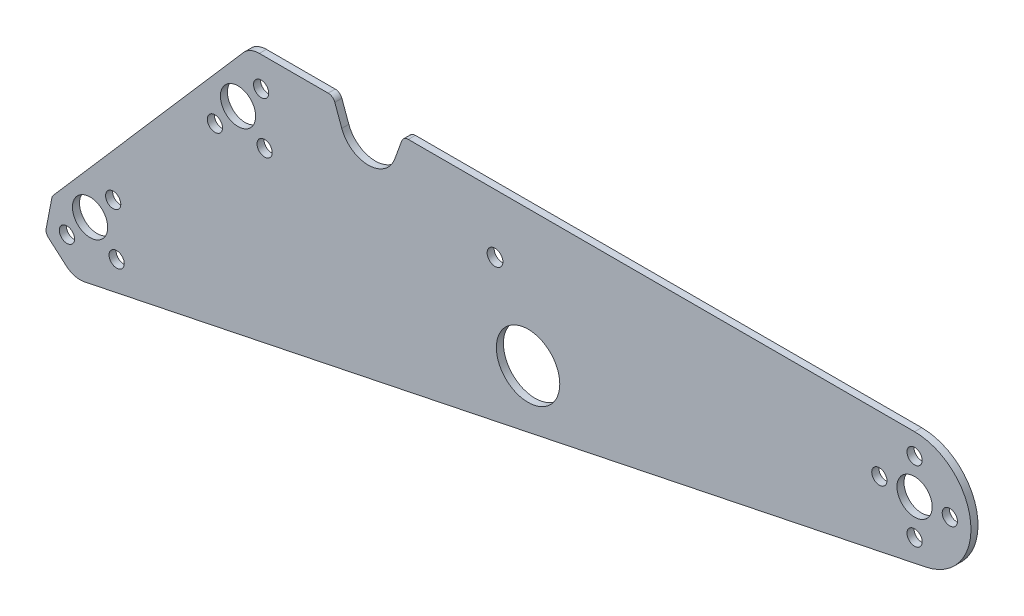
ISO-10303-21;
HEADER;
FILE_DESCRIPTION(('STEP AP214'),'2;1');
FILE_NAME('part.step','',(''),(''),'','','');
FILE_SCHEMA(('AUTOMOTIVE_DESIGN { 1 0 10303 214 1 1 1 1 }'));
ENDSEC;
DATA;
#1=APPLICATION_CONTEXT('core data for automotive mechanical design processes');
#2=APPLICATION_PROTOCOL_DEFINITION('international standard','automotive_design',2000,#1);
#3=PRODUCT_CONTEXT('',#1,'mechanical');
#4=PRODUCT('Part','Part','',(#3));
#5=PRODUCT_RELATED_PRODUCT_CATEGORY('part','',(#4));
#6=PRODUCT_DEFINITION_FORMATION('','',#4);
#7=PRODUCT_DEFINITION_CONTEXT('part definition',#1,'design');
#8=PRODUCT_DEFINITION('design','',#6,#7);
#9=PRODUCT_DEFINITION_SHAPE('','',#8);
#10=(LENGTH_UNIT() NAMED_UNIT(*) SI_UNIT(.MILLI.,.METRE.));
#11=(NAMED_UNIT(*) PLANE_ANGLE_UNIT() SI_UNIT($,.RADIAN.));
#12=(NAMED_UNIT(*) SI_UNIT($,.STERADIAN.) SOLID_ANGLE_UNIT());
#13=UNCERTAINTY_MEASURE_WITH_UNIT(LENGTH_MEASURE(1.E-05),#10,'distance_accuracy_value','');
#14=(GEOMETRIC_REPRESENTATION_CONTEXT(3) GLOBAL_UNCERTAINTY_ASSIGNED_CONTEXT((#13)) GLOBAL_UNIT_ASSIGNED_CONTEXT((#10,
#11,#12)) REPRESENTATION_CONTEXT('',''));
#15=CARTESIAN_POINT('',(0.,0.,0.));
#16=DIRECTION('',(0.,0.,1.));
#17=DIRECTION('',(1.,0.,0.));
#18=AXIS2_PLACEMENT_3D('',#15,#16,#17);
#19=CARTESIAN_POINT('',(-83.3352427436473,-91.627512591668,3.175));
#20=DIRECTION('',(0.,0.,1.));
#21=DIRECTION('',(1.,0.,0.));
#22=AXIS2_PLACEMENT_3D('',#19,#20,#21);
#23=PLANE('',#22);
#24=CARTESIAN_POINT('',(10.4149370852242,11.9810145860366,3.175));
#25=DIRECTION('',(0.,0.,1.));
#26=DIRECTION('',(1.,0.,0.));
#27=AXIS2_PLACEMENT_3D('',#24,#25,#26);
#28=CIRCLE('',#27,3.429);
#29=CARTESIAN_POINT('',(13.8439370852242,11.9810145860366,3.175));
#30=VERTEX_POINT('',#29);
#31=EDGE_CURVE('E446',#30,#30,#28,.T.);
#32=ORIENTED_EDGE('',*,*,#31,.F.);
#33=EDGE_LOOP('',(#32));
#34=FACE_BOUND('',#33,.T.);
#35=CARTESIAN_POINT('',(304.800000000001,-15.875,3.175));
#36=DIRECTION('',(0.,0.,1.));
#37=DIRECTION('',(1.,0.,0.));
#38=AXIS2_PLACEMENT_3D('',#35,#36,#37);
#39=CIRCLE('',#38,3.429);
#40=CARTESIAN_POINT('',(308.229000000001,-15.875,3.175));
#41=VERTEX_POINT('',#40);
#42=EDGE_CURVE('E462',#41,#41,#39,.T.);
#43=ORIENTED_EDGE('',*,*,#42,.F.);
#44=EDGE_LOOP('',(#43));
#45=FACE_BOUND('',#44,.T.);
#46=CARTESIAN_POINT('',(11.9810145860366,-10.4149370852242,3.175));
#47=DIRECTION('',(0.,0.,1.));
#48=DIRECTION('',(1.,0.,0.));
#49=AXIS2_PLACEMENT_3D('',#46,#47,#48);
#50=CIRCLE('',#49,3.429);
#51=CARTESIAN_POINT('',(15.4100145860366,-10.4149370852242,3.175));
#52=VERTEX_POINT('',#51);
#53=EDGE_CURVE('E478',#52,#52,#50,.T.);
#54=ORIENTED_EDGE('',*,*,#53,.F.);
#55=EDGE_LOOP('',(#54));
#56=FACE_BOUND('',#55,.T.);
#57=CARTESIAN_POINT('',(304.8,15.875,3.175));
#58=DIRECTION('',(0.,0.,1.));
#59=DIRECTION('',(1.,0.,0.));
#60=AXIS2_PLACEMENT_3D('',#57,#58,#59);
#61=CIRCLE('',#60,3.429);
#62=CARTESIAN_POINT('',(308.229,15.875,3.175));
#63=VERTEX_POINT('',#62);
#64=EDGE_CURVE('E494',#63,#63,#61,.T.);
#65=ORIENTED_EDGE('',*,*,#64,.F.);
#66=EDGE_LOOP('',(#65));
#67=FACE_BOUND('',#66,.T.);
#68=CARTESIAN_POINT('',(-56.2406602602111,-64.6974787645972,3.175));
#69=DIRECTION('',(0.,0.,1.));
#70=DIRECTION('',(1.,0.,0.));
#71=AXIS2_PLACEMENT_3D('',#68,#69,#70);
#72=CIRCLE('',#71,3.429);
#73=CARTESIAN_POINT('',(-52.8116602602111,-64.6974787645972,3.175));
#74=VERTEX_POINT('',#73);
#75=EDGE_CURVE('E510',#74,#74,#72,.T.);
#76=ORIENTED_EDGE('',*,*,#75,.F.);
#77=EDGE_LOOP('',(#76));
#78=FACE_BOUND('',#77,.T.);
#79=CARTESIAN_POINT('',(-10.4149370852243,-11.9810145860365,3.175));
#80=DIRECTION('',(0.,0.,1.));
#81=DIRECTION('',(1.,0.,0.));
#82=AXIS2_PLACEMENT_3D('',#79,#80,#81);
#83=CIRCLE('',#82,3.429);
#84=CARTESIAN_POINT('',(-6.98593708522428,-11.9810145860365,3.175));
#85=VERTEX_POINT('',#84);
#86=EDGE_CURVE('E526',#85,#85,#83,.T.);
#87=ORIENTED_EDGE('',*,*,#86,.F.);
#88=EDGE_LOOP('',(#87));
#89=FACE_BOUND('',#88,.T.);
#90=CARTESIAN_POINT('',(0.,0.,3.175));
#91=DIRECTION('',(0.,0.,1.));
#92=DIRECTION('',(1.,0.,0.));
#93=AXIS2_PLACEMENT_3D('',#90,#91,#92);
#94=CIRCLE('',#93,7.93750000000001);
#95=CARTESIAN_POINT('',(7.93750000000001,0.,3.175));
#96=VERTEX_POINT('',#95);
#97=EDGE_CURVE('E542',#96,#96,#94,.T.);
#98=ORIENTED_EDGE('',*,*,#97,.F.);
#99=EDGE_LOOP('',(#98));
#100=FACE_BOUND('',#99,.T.);
#101=CARTESIAN_POINT('',(-83.3352427436473,-91.627512591668,3.175));
#102=DIRECTION('',(0.,0.,1.));
#103=DIRECTION('',(1.,0.,0.));
#104=AXIS2_PLACEMENT_3D('',#101,#102,#103);
#105=CIRCLE('',#104,3.175);
#106=CARTESIAN_POINT('',(-86.4519090510937,-91.0216940313475,3.175));
#107=VERTEX_POINT('',#106);
#108=CARTESIAN_POINT('',(-85.4182301606922,-94.0237155088753,3.175));
#109=VERTEX_POINT('',#108);
#110=EDGE_CURVE('E242',#107,#109,#105,.T.);
#111=ORIENTED_EDGE('',*,*,#110,.T.);
#112=DIRECTION('',(0.754709580222775,-0.656059028990504,0.));
#113=VECTOR('',#112,1.);
#114=CARTESIAN_POINT('',(-85.4182301606922,-94.0237155088753,3.175));
#115=LINE('',#114,#113);
#116=CARTESIAN_POINT('',(-77.3898379162977,-101.002690412914,3.175));
#117=VERTEX_POINT('',#116);
#118=EDGE_CURVE('E130',#109,#117,#115,.T.);
#119=ORIENTED_EDGE('',*,*,#118,.T.);
#120=CARTESIAN_POINT('',(-71.1408756651632,-93.8140816612921,3.175));
#121=DIRECTION('',(0.,0.,1.));
#122=DIRECTION('',(-1.,0.,0.));
#123=AXIS2_PLACEMENT_3D('',#120,#121,#122);
#124=CIRCLE('',#123,9.525);
#125=CARTESIAN_POINT('',(-69.2152571200399,-103.142405102226,3.175));
#126=VERTEX_POINT('',#125);
#127=EDGE_CURVE('E295',#117,#126,#124,.T.);
#128=ORIENTED_EDGE('',*,*,#127,.T.);
#129=DIRECTION('',(0.979351542355268,0.202164676653362,0.));
#130=VECTOR('',#129,1.);
#131=CARTESIAN_POINT('',(-69.2152571200399,-103.142405102226,3.175));
#132=LINE('',#131,#130);
#133=CARTESIAN_POINT('',(309.934982786995,-24.8755291758238,3.175));
#134=VERTEX_POINT('',#133);
#135=EDGE_CURVE('E315',#126,#134,#132,.T.);
#136=ORIENTED_EDGE('',*,*,#135,.T.);
#137=CARTESIAN_POINT('',(304.8,0.,3.175));
#138=DIRECTION('',(0.,0.,1.));
#139=DIRECTION('',(-1.,0.,0.));
#140=AXIS2_PLACEMENT_3D('',#137,#138,#139);
#141=CIRCLE('',#140,25.4);
#142=CARTESIAN_POINT('',(304.8,25.4,3.175));
#143=VERTEX_POINT('',#142);
#144=EDGE_CURVE('E311',#134,#143,#141,.T.);
#145=ORIENTED_EDGE('',*,*,#144,.T.);
#146=DIRECTION('',(-1.,0.,0.));
#147=VECTOR('',#146,1.);
#148=CARTESIAN_POINT('',(304.8,25.4,3.175));
#149=LINE('',#148,#147);
#150=CARTESIAN_POINT('',(76.7243647170746,25.3999999999999,3.175));
#151=VERTEX_POINT('',#150);
#152=EDGE_CURVE('E314',#143,#151,#149,.T.);
#153=ORIENTED_EDGE('',*,*,#152,.T.);
#154=CARTESIAN_POINT('',(76.7243647170745,22.2249999999999,3.175));
#155=DIRECTION('',(0.,0.,1.));
#156=DIRECTION('',(-1.,0.,0.));
#157=AXIS2_PLACEMENT_3D('',#154,#155,#156);
#158=CIRCLE('',#157,3.175);
#159=CARTESIAN_POINT('',(73.7408406460793,23.3109139550589,3.175));
#160=VERTEX_POINT('',#159);
#161=EDGE_CURVE('E319',#151,#160,#158,.T.);
#162=ORIENTED_EDGE('',*,*,#161,.T.);
#163=DIRECTION('',(-0.342020143325673,-0.939692620785907,0.));
#164=VECTOR('',#163,1.);
#165=CARTESIAN_POINT('',(70.6090333692052,14.7063441797639,3.175));
#166=LINE('',#165,#164);
#167=CARTESIAN_POINT('',(70.6090333692052,14.7063441797639,3.175));
#168=VERTEX_POINT('',#167);
#169=EDGE_CURVE('E326',#160,#168,#166,.T.);
#170=ORIENTED_EDGE('',*,*,#169,.T.);
#171=CARTESIAN_POINT('',(58.6749370852242,19.0499999999999,3.175));
#172=DIRECTION('',(0.,0.,-1.));
#173=DIRECTION('',(1.,0.,0.));
#174=AXIS2_PLACEMENT_3D('',#171,#172,#173);
#175=CIRCLE('',#174,12.7);
#176=CARTESIAN_POINT('',(46.7408408012431,14.706344179764,3.175));
#177=VERTEX_POINT('',#176);
#178=EDGE_CURVE('E329',#168,#177,#175,.T.);
#179=ORIENTED_EDGE('',*,*,#178,.T.);
#180=DIRECTION('',(-0.342020143325666,0.939692620785909,0.));
#181=VECTOR('',#180,1.);
#182=CARTESIAN_POINT('',(46.7408408012431,14.706344179764,3.175));
#183=LINE('',#182,#181);
#184=CARTESIAN_POINT('',(43.6090335243692,23.3109139550589,3.175));
#185=VERTEX_POINT('',#184);
#186=EDGE_CURVE('E332',#177,#185,#183,.T.);
#187=ORIENTED_EDGE('',*,*,#186,.T.);
#188=CARTESIAN_POINT('',(40.6255094533739,22.2249999999999,3.175));
#189=DIRECTION('',(0.,0.,1.));
#190=DIRECTION('',(1.,0.,0.));
#191=AXIS2_PLACEMENT_3D('',#188,#189,#190);
#192=CIRCLE('',#191,3.175);
#193=CARTESIAN_POINT('',(40.6255094533739,25.3999999999999,3.175));
#194=VERTEX_POINT('',#193);
#195=EDGE_CURVE('E335',#185,#194,#192,.T.);
#196=ORIENTED_EDGE('',*,*,#195,.T.);
#197=DIRECTION('',(-1.,0.,0.));
#198=VECTOR('',#197,1.);
#199=CARTESIAN_POINT('',(40.6255094533739,25.3999999999999,3.175));
#200=LINE('',#199,#198);
#201=CARTESIAN_POINT('',(9.59301070895002,25.3999999999999,3.175));
#202=VERTEX_POINT('',#201);
#203=EDGE_CURVE('E338',#194,#202,#200,.T.);
#204=ORIENTED_EDGE('',*,*,#203,.T.);
#205=CARTESIAN_POINT('',(9.59301070895002,15.8749999999999,3.175));
#206=DIRECTION('',(0.,0.,1.));
#207=DIRECTION('',(1.,0.,0.));
#208=AXIS2_PLACEMENT_3D('',#205,#206,#207);
#209=CIRCLE('',#208,9.52500000000002);
#210=CARTESIAN_POINT('',(2.40440195732808,22.1239622511345,3.175));
#211=VERTEX_POINT('',#210);
#212=EDGE_CURVE('E173',#202,#211,#209,.T.);
#213=ORIENTED_EDGE('',*,*,#212,.T.);
#214=DIRECTION('',(-0.656059028990506,-0.754709580222774,0.));
#215=VECTOR('',#214,1.);
#216=CARTESIAN_POINT('',(-83.1577563561721,-76.304041526359,3.175));
#217=LINE('',#216,#215);
#218=CARTESIAN_POINT('',(-83.1577563561721,-76.304041526359,3.175));
#219=VERTEX_POINT('',#218);
#220=EDGE_CURVE('E167',#211,#219,#217,.T.);
#221=ORIENTED_EDGE('',*,*,#220,.T.);
#222=CARTESIAN_POINT('',(-80.7615534389648,-78.3870289434039,3.175));
#223=DIRECTION('',(0.,0.,1.));
#224=DIRECTION('',(-1.,0.,0.));
#225=AXIS2_PLACEMENT_3D('',#222,#223,#224);
#226=CIRCLE('',#225,3.17500000000002);
#227=CARTESIAN_POINT('',(-83.8782197464111,-77.7812103830833,3.175));
#228=VERTEX_POINT('',#227);
#229=EDGE_CURVE('E171',#219,#228,#226,.T.);
#230=ORIENTED_EDGE('',*,*,#229,.T.);
#231=DIRECTION('',(-0.190808995376547,-0.981627183447663,0.));
#232=VECTOR('',#231,1.);
#233=CARTESIAN_POINT('',(-83.8782197464111,-77.7812103830833,3.175));
#234=LINE('',#233,#232);
#235=EDGE_CURVE('E63',#228,#107,#234,.T.);
#236=ORIENTED_EDGE('',*,*,#235,.T.);
#237=EDGE_LOOP('',(#111,#119,#128,#136,#145,#153,#162,#170,#179,#187,#196,#204,#213,#221,#230,#236));
#238=FACE_BOUND('',#237,.T.);
#239=CARTESIAN_POINT('',(304.8,0.,3.175));
#240=DIRECTION('',(0.,0.,1.));
#241=DIRECTION('',(1.,0.,0.));
#242=AXIS2_PLACEMENT_3D('',#239,#240,#241);
#243=CIRCLE('',#242,7.93749999999998);
#244=CARTESIAN_POINT('',(312.7375,0.,3.175));
#245=VERTEX_POINT('',#244);
#246=EDGE_CURVE('E200',#245,#245,#243,.T.);
#247=ORIENTED_EDGE('',*,*,#246,.F.);
#248=EDGE_LOOP('',(#247));
#249=FACE_BOUND('',#248,.T.);
#250=CARTESIAN_POINT('',(-66.6555973454354,-76.6784933506338,3.175));
#251=DIRECTION('',(0.,0.,1.));
#252=DIRECTION('',(1.,0.,0.));
#253=AXIS2_PLACEMENT_3D('',#250,#251,#252);
#254=CIRCLE('',#253,7.9375);
#255=CARTESIAN_POINT('',(-58.7180973454354,-76.6784933506338,3.175));
#256=VERTEX_POINT('',#255);
#257=EDGE_CURVE('E534',#256,#256,#254,.T.);
#258=ORIENTED_EDGE('',*,*,#257,.F.);
#259=EDGE_LOOP('',(#258));
#260=FACE_BOUND('',#259,.T.);
#261=CARTESIAN_POINT('',(-54.6745827593989,-87.0934304358582,3.175));
#262=DIRECTION('',(0.,0.,1.));
#263=DIRECTION('',(1.,0.,0.));
#264=AXIS2_PLACEMENT_3D('',#261,#262,#263);
#265=CIRCLE('',#264,3.42900000000001);
#266=CARTESIAN_POINT('',(-51.2455827593989,-87.0934304358582,3.175));
#267=VERTEX_POINT('',#266);
#268=EDGE_CURVE('E518',#267,#267,#265,.T.);
#269=ORIENTED_EDGE('',*,*,#268,.F.);
#270=EDGE_LOOP('',(#269));
#271=FACE_BOUND('',#270,.T.);
#272=CARTESIAN_POINT('',(-77.0705344306598,-88.6595079366703,3.175));
#273=DIRECTION('',(0.,0.,1.));
#274=DIRECTION('',(1.,0.,0.));
#275=AXIS2_PLACEMENT_3D('',#272,#273,#274);
#276=CIRCLE('',#275,3.42900000000001);
#277=CARTESIAN_POINT('',(-73.6415344306598,-88.6595079366703,3.175));
#278=VERTEX_POINT('',#277);
#279=EDGE_CURVE('E502',#278,#278,#276,.T.);
#280=ORIENTED_EDGE('',*,*,#279,.F.);
#281=EDGE_LOOP('',(#280));
#282=FACE_BOUND('',#281,.T.);
#283=CARTESIAN_POINT('',(130.671295769233,-35.9448795089677,3.175));
#284=DIRECTION('',(0.,0.,1.));
#285=DIRECTION('',(1.,0.,0.));
#286=AXIS2_PLACEMENT_3D('',#283,#284,#285);
#287=CIRCLE('',#286,14.2875);
#288=CARTESIAN_POINT('',(144.958795769233,-35.9448795089677,3.175));
#289=VERTEX_POINT('',#288);
#290=EDGE_CURVE('E486',#289,#289,#287,.T.);
#291=ORIENTED_EDGE('',*,*,#290,.F.);
#292=EDGE_LOOP('',(#291));
#293=FACE_BOUND('',#292,.T.);
#294=CARTESIAN_POINT('',(320.675,3.88578058618805E-13,3.175));
#295=DIRECTION('',(0.,0.,1.));
#296=DIRECTION('',(1.,0.,0.));
#297=AXIS2_PLACEMENT_3D('',#294,#295,#296);
#298=CIRCLE('',#297,3.429);
#299=CARTESIAN_POINT('',(324.104,3.88578058618805E-13,3.175));
#300=VERTEX_POINT('',#299);
#301=EDGE_CURVE('E470',#300,#300,#298,.T.);
#302=ORIENTED_EDGE('',*,*,#301,.F.);
#303=EDGE_LOOP('',(#302));
#304=FACE_BOUND('',#303,.T.);
#305=CARTESIAN_POINT('',(288.925,-2.77555756156289E-13,3.175));
#306=DIRECTION('',(0.,0.,1.));
#307=DIRECTION('',(1.,0.,0.));
#308=AXIS2_PLACEMENT_3D('',#305,#306,#307);
#309=CIRCLE('',#308,3.429);
#310=CARTESIAN_POINT('',(292.354,-2.77555756156289E-13,3.175));
#311=VERTEX_POINT('',#310);
#312=EDGE_CURVE('E454',#311,#311,#309,.T.);
#313=ORIENTED_EDGE('',*,*,#312,.F.);
#314=EDGE_LOOP('',(#313));
#315=FACE_BOUND('',#314,.T.);
#316=CARTESIAN_POINT('',(115.786625942557,-1.08739889200005,3.175));
#317=DIRECTION('',(0.,0.,1.));
#318=DIRECTION('',(1.,0.,0.));
#319=AXIS2_PLACEMENT_3D('',#316,#317,#318);
#320=CIRCLE('',#319,3.556);
#321=CARTESIAN_POINT('',(119.342625942557,-1.08739889200005,3.175));
#322=VERTEX_POINT('',#321);
#323=EDGE_CURVE('E435',#322,#322,#320,.T.);
#324=ORIENTED_EDGE('',*,*,#323,.F.);
#325=EDGE_LOOP('',(#324));
#326=FACE_BOUND('',#325,.T.);
#327=ADVANCED_FACE('F45',(#34,#45,#56,#67,#78,#89,#100,#238,#249,#260,#271,#282,#293,#304,#315,
#326),#23,.T.);
#328=CARTESIAN_POINT('',(-83.3352427436473,-91.627512591668,0.));
#329=DIRECTION('',(0.,0.,1.));
#330=DIRECTION('',(1.,0.,0.));
#331=AXIS2_PLACEMENT_3D('',#328,#329,#330);
#332=PLANE('',#331);
#333=CARTESIAN_POINT('',(-83.3352427436473,-91.627512591668,0.));
#334=DIRECTION('',(0.,0.,1.));
#335=DIRECTION('',(1.,0.,0.));
#336=AXIS2_PLACEMENT_3D('',#333,#334,#335);
#337=CIRCLE('',#336,3.175);
#338=CARTESIAN_POINT('',(-86.4519090510937,-91.0216940313475,0.));
#339=VERTEX_POINT('',#338);
#340=CARTESIAN_POINT('',(-85.4182301606922,-94.0237155088753,0.));
#341=VERTEX_POINT('',#340);
#342=EDGE_CURVE('E195',#339,#341,#337,.T.);
#343=ORIENTED_EDGE('',*,*,#342,.F.);
#344=DIRECTION('',(-0.190808995376547,-0.981627183447663,0.));
#345=VECTOR('',#344,1.);
#346=CARTESIAN_POINT('',(-83.8782197464111,-77.7812103830833,0.));
#347=LINE('',#346,#345);
#348=CARTESIAN_POINT('',(-83.8782197464111,-77.7812103830833,0.));
#349=VERTEX_POINT('',#348);
#350=EDGE_CURVE('E122',#349,#339,#347,.T.);
#351=ORIENTED_EDGE('',*,*,#350,.F.);
#352=CARTESIAN_POINT('',(-80.7615534389648,-78.3870289434039,0.));
#353=DIRECTION('',(0.,0.,1.));
#354=DIRECTION('',(-1.,0.,0.));
#355=AXIS2_PLACEMENT_3D('',#352,#353,#354);
#356=CIRCLE('',#355,3.17500000000002);
#357=CARTESIAN_POINT('',(-83.1577563561721,-76.304041526359,0.));
#358=VERTEX_POINT('',#357);
#359=EDGE_CURVE('E116',#358,#349,#356,.T.);
#360=ORIENTED_EDGE('',*,*,#359,.F.);
#361=DIRECTION('',(-0.656059028990506,-0.754709580222774,0.));
#362=VECTOR('',#361,1.);
#363=CARTESIAN_POINT('',(-83.1577563561721,-76.304041526359,0.));
#364=LINE('',#363,#362);
#365=CARTESIAN_POINT('',(2.40440195732808,22.1239622511345,0.));
#366=VERTEX_POINT('',#365);
#367=EDGE_CURVE('E182',#366,#358,#364,.T.);
#368=ORIENTED_EDGE('',*,*,#367,.F.);
#369=CARTESIAN_POINT('',(9.59301070895002,15.8749999999999,0.));
#370=DIRECTION('',(0.,0.,1.));
#371=DIRECTION('',(1.,0.,0.));
#372=AXIS2_PLACEMENT_3D('',#369,#370,#371);
#373=CIRCLE('',#372,9.52500000000002);
#374=CARTESIAN_POINT('',(9.59301070895002,25.3999999999999,0.));
#375=VERTEX_POINT('',#374);
#376=EDGE_CURVE('E233',#375,#366,#373,.T.);
#377=ORIENTED_EDGE('',*,*,#376,.F.);
#378=DIRECTION('',(-1.,0.,0.));
#379=VECTOR('',#378,1.);
#380=CARTESIAN_POINT('',(40.6255094533739,25.3999999999999,0.));
#381=LINE('',#380,#379);
#382=CARTESIAN_POINT('',(40.6255094533739,25.3999999999999,0.));
#383=VERTEX_POINT('',#382);
#384=EDGE_CURVE('E230',#383,#375,#381,.T.);
#385=ORIENTED_EDGE('',*,*,#384,.F.);
#386=CARTESIAN_POINT('',(40.6255094533739,22.2249999999999,0.));
#387=DIRECTION('',(0.,0.,1.));
#388=DIRECTION('',(1.,0.,0.));
#389=AXIS2_PLACEMENT_3D('',#386,#387,#388);
#390=CIRCLE('',#389,3.175);
#391=CARTESIAN_POINT('',(43.6090335243692,23.3109139550589,0.));
#392=VERTEX_POINT('',#391);
#393=EDGE_CURVE('E227',#392,#383,#390,.T.);
#394=ORIENTED_EDGE('',*,*,#393,.F.);
#395=DIRECTION('',(-0.342020143325666,0.939692620785909,0.));
#396=VECTOR('',#395,1.);
#397=CARTESIAN_POINT('',(46.7408408012431,14.706344179764,0.));
#398=LINE('',#397,#396);
#399=CARTESIAN_POINT('',(46.7408408012431,14.706344179764,0.));
#400=VERTEX_POINT('',#399);
#401=EDGE_CURVE('E224',#400,#392,#398,.T.);
#402=ORIENTED_EDGE('',*,*,#401,.F.);
#403=CARTESIAN_POINT('',(58.6749370852242,19.0499999999999,0.));
#404=DIRECTION('',(0.,0.,-1.));
#405=DIRECTION('',(1.,0.,0.));
#406=AXIS2_PLACEMENT_3D('',#403,#404,#405);
#407=CIRCLE('',#406,12.7);
#408=CARTESIAN_POINT('',(70.6090333692052,14.7063441797639,0.));
#409=VERTEX_POINT('',#408);
#410=EDGE_CURVE('E221',#409,#400,#407,.T.);
#411=ORIENTED_EDGE('',*,*,#410,.F.);
#412=DIRECTION('',(-0.342020143325673,-0.939692620785907,0.));
#413=VECTOR('',#412,1.);
#414=CARTESIAN_POINT('',(70.6090333692052,14.7063441797639,0.));
#415=LINE('',#414,#413);
#416=CARTESIAN_POINT('',(73.7408406460793,23.3109139550589,0.));
#417=VERTEX_POINT('',#416);
#418=EDGE_CURVE('E218',#417,#409,#415,.T.);
#419=ORIENTED_EDGE('',*,*,#418,.F.);
#420=CARTESIAN_POINT('',(76.7243647170745,22.2249999999999,0.));
#421=DIRECTION('',(0.,0.,1.));
#422=DIRECTION('',(-1.,0.,0.));
#423=AXIS2_PLACEMENT_3D('',#420,#421,#422);
#424=CIRCLE('',#423,3.175);
#425=CARTESIAN_POINT('',(76.7243647170746,25.3999999999999,0.));
#426=VERTEX_POINT('',#425);
#427=EDGE_CURVE('E215',#426,#417,#424,.T.);
#428=ORIENTED_EDGE('',*,*,#427,.F.);
#429=DIRECTION('',(-1.,0.,0.));
#430=VECTOR('',#429,1.);
#431=CARTESIAN_POINT('',(304.8,25.4,0.));
#432=LINE('',#431,#430);
#433=CARTESIAN_POINT('',(304.8,25.4,0.));
#434=VERTEX_POINT('',#433);
#435=EDGE_CURVE('E212',#434,#426,#432,.T.);
#436=ORIENTED_EDGE('',*,*,#435,.F.);
#437=CARTESIAN_POINT('',(304.8,0.,0.));
#438=DIRECTION('',(0.,0.,1.));
#439=DIRECTION('',(-1.,0.,0.));
#440=AXIS2_PLACEMENT_3D('',#437,#438,#439);
#441=CIRCLE('',#440,25.4);
#442=CARTESIAN_POINT('',(309.934982786995,-24.8755291758238,0.));
#443=VERTEX_POINT('',#442);
#444=EDGE_CURVE('E209',#443,#434,#441,.T.);
#445=ORIENTED_EDGE('',*,*,#444,.F.);
#446=DIRECTION('',(0.979351542355268,0.202164676653362,0.));
#447=VECTOR('',#446,1.);
#448=CARTESIAN_POINT('',(-69.2152571200399,-103.142405102226,0.));
#449=LINE('',#448,#447);
#450=CARTESIAN_POINT('',(-69.2152571200399,-103.142405102226,0.));
#451=VERTEX_POINT('',#450);
#452=EDGE_CURVE('E206',#451,#443,#449,.T.);
#453=ORIENTED_EDGE('',*,*,#452,.F.);
#454=CARTESIAN_POINT('',(-71.1408756651632,-93.8140816612921,0.));
#455=DIRECTION('',(0.,0.,1.));
#456=DIRECTION('',(-1.,0.,0.));
#457=AXIS2_PLACEMENT_3D('',#454,#455,#456);
#458=CIRCLE('',#457,9.525);
#459=CARTESIAN_POINT('',(-77.3898379162977,-101.002690412914,0.));
#460=VERTEX_POINT('',#459);
#461=EDGE_CURVE('E203',#460,#451,#458,.T.);
#462=ORIENTED_EDGE('',*,*,#461,.F.);
#463=DIRECTION('',(0.754709580222775,-0.656059028990504,0.));
#464=VECTOR('',#463,1.);
#465=CARTESIAN_POINT('',(-85.4182301606922,-94.0237155088753,0.));
#466=LINE('',#465,#464);
#467=EDGE_CURVE('E199',#341,#460,#466,.T.);
#468=ORIENTED_EDGE('',*,*,#467,.F.);
#469=EDGE_LOOP('',(#343,#351,#360,#368,#377,#385,#394,#402,#411,#419,#428,#436,#445,#453,#462,#468));
#470=FACE_BOUND('',#469,.T.);
#471=CARTESIAN_POINT('',(304.8,0.,0.));
#472=DIRECTION('',(0.,0.,1.));
#473=DIRECTION('',(1.,0.,0.));
#474=AXIS2_PLACEMENT_3D('',#471,#472,#473);
#475=CIRCLE('',#474,7.93749999999998);
#476=CARTESIAN_POINT('',(312.7375,0.,0.));
#477=VERTEX_POINT('',#476);
#478=EDGE_CURVE('E546',#477,#477,#475,.T.);
#479=ORIENTED_EDGE('',*,*,#478,.T.);
#480=EDGE_LOOP('',(#479));
#481=FACE_BOUND('',#480,.T.);
#482=CARTESIAN_POINT('',(0.,0.,0.));
#483=DIRECTION('',(0.,0.,1.));
#484=DIRECTION('',(1.,0.,0.));
#485=AXIS2_PLACEMENT_3D('',#482,#483,#484);
#486=CIRCLE('',#485,7.93750000000001);
#487=CARTESIAN_POINT('',(7.93750000000001,0.,0.));
#488=VERTEX_POINT('',#487);
#489=EDGE_CURVE('E538',#488,#488,#486,.T.);
#490=ORIENTED_EDGE('',*,*,#489,.T.);
#491=EDGE_LOOP('',(#490));
#492=FACE_BOUND('',#491,.T.);
#493=CARTESIAN_POINT('',(-66.6555973454354,-76.6784933506338,0.));
#494=DIRECTION('',(0.,0.,1.));
#495=DIRECTION('',(1.,0.,0.));
#496=AXIS2_PLACEMENT_3D('',#493,#494,#495);
#497=CIRCLE('',#496,7.9375);
#498=CARTESIAN_POINT('',(-58.7180973454354,-76.6784933506338,0.));
#499=VERTEX_POINT('',#498);
#500=EDGE_CURVE('E530',#499,#499,#497,.T.);
#501=ORIENTED_EDGE('',*,*,#500,.T.);
#502=EDGE_LOOP('',(#501));
#503=FACE_BOUND('',#502,.T.);
#504=CARTESIAN_POINT('',(-10.4149370852243,-11.9810145860365,0.));
#505=DIRECTION('',(0.,0.,1.));
#506=DIRECTION('',(1.,0.,0.));
#507=AXIS2_PLACEMENT_3D('',#504,#505,#506);
#508=CIRCLE('',#507,3.429);
#509=CARTESIAN_POINT('',(-6.98593708522428,-11.9810145860365,0.));
#510=VERTEX_POINT('',#509);
#511=EDGE_CURVE('E522',#510,#510,#508,.T.);
#512=ORIENTED_EDGE('',*,*,#511,.T.);
#513=EDGE_LOOP('',(#512));
#514=FACE_BOUND('',#513,.T.);
#515=CARTESIAN_POINT('',(-54.6745827593989,-87.0934304358582,0.));
#516=DIRECTION('',(0.,0.,1.));
#517=DIRECTION('',(1.,0.,0.));
#518=AXIS2_PLACEMENT_3D('',#515,#516,#517);
#519=CIRCLE('',#518,3.42900000000001);
#520=CARTESIAN_POINT('',(-51.2455827593989,-87.0934304358582,0.));
#521=VERTEX_POINT('',#520);
#522=EDGE_CURVE('E514',#521,#521,#519,.T.);
#523=ORIENTED_EDGE('',*,*,#522,.T.);
#524=EDGE_LOOP('',(#523));
#525=FACE_BOUND('',#524,.T.);
#526=CARTESIAN_POINT('',(-56.2406602602111,-64.6974787645972,0.));
#527=DIRECTION('',(0.,0.,1.));
#528=DIRECTION('',(1.,0.,0.));
#529=AXIS2_PLACEMENT_3D('',#526,#527,#528);
#530=CIRCLE('',#529,3.429);
#531=CARTESIAN_POINT('',(-52.8116602602111,-64.6974787645972,0.));
#532=VERTEX_POINT('',#531);
#533=EDGE_CURVE('E506',#532,#532,#530,.T.);
#534=ORIENTED_EDGE('',*,*,#533,.T.);
#535=EDGE_LOOP('',(#534));
#536=FACE_BOUND('',#535,.T.);
#537=CARTESIAN_POINT('',(-77.0705344306598,-88.6595079366703,0.));
#538=DIRECTION('',(0.,0.,1.));
#539=DIRECTION('',(1.,0.,0.));
#540=AXIS2_PLACEMENT_3D('',#537,#538,#539);
#541=CIRCLE('',#540,3.42900000000001);
#542=CARTESIAN_POINT('',(-73.6415344306598,-88.6595079366703,0.));
#543=VERTEX_POINT('',#542);
#544=EDGE_CURVE('E498',#543,#543,#541,.T.);
#545=ORIENTED_EDGE('',*,*,#544,.T.);
#546=EDGE_LOOP('',(#545));
#547=FACE_BOUND('',#546,.T.);
#548=CARTESIAN_POINT('',(304.8,15.875,0.));
#549=DIRECTION('',(0.,0.,1.));
#550=DIRECTION('',(1.,0.,0.));
#551=AXIS2_PLACEMENT_3D('',#548,#549,#550);
#552=CIRCLE('',#551,3.429);
#553=CARTESIAN_POINT('',(308.229,15.875,0.));
#554=VERTEX_POINT('',#553);
#555=EDGE_CURVE('E490',#554,#554,#552,.T.);
#556=ORIENTED_EDGE('',*,*,#555,.T.);
#557=EDGE_LOOP('',(#556));
#558=FACE_BOUND('',#557,.T.);
#559=CARTESIAN_POINT('',(130.671295769233,-35.9448795089677,0.));
#560=DIRECTION('',(0.,0.,1.));
#561=DIRECTION('',(1.,0.,0.));
#562=AXIS2_PLACEMENT_3D('',#559,#560,#561);
#563=CIRCLE('',#562,14.2875);
#564=CARTESIAN_POINT('',(144.958795769233,-35.9448795089677,0.));
#565=VERTEX_POINT('',#564);
#566=EDGE_CURVE('E482',#565,#565,#563,.T.);
#567=ORIENTED_EDGE('',*,*,#566,.T.);
#568=EDGE_LOOP('',(#567));
#569=FACE_BOUND('',#568,.T.);
#570=CARTESIAN_POINT('',(11.9810145860366,-10.4149370852242,0.));
#571=DIRECTION('',(0.,0.,1.));
#572=DIRECTION('',(1.,0.,0.));
#573=AXIS2_PLACEMENT_3D('',#570,#571,#572);
#574=CIRCLE('',#573,3.429);
#575=CARTESIAN_POINT('',(15.4100145860366,-10.4149370852242,0.));
#576=VERTEX_POINT('',#575);
#577=EDGE_CURVE('E474',#576,#576,#574,.T.);
#578=ORIENTED_EDGE('',*,*,#577,.T.);
#579=EDGE_LOOP('',(#578));
#580=FACE_BOUND('',#579,.T.);
#581=CARTESIAN_POINT('',(320.675,3.88578058618805E-13,0.));
#582=DIRECTION('',(0.,0.,1.));
#583=DIRECTION('',(1.,0.,0.));
#584=AXIS2_PLACEMENT_3D('',#581,#582,#583);
#585=CIRCLE('',#584,3.429);
#586=CARTESIAN_POINT('',(324.104,3.88578058618805E-13,0.));
#587=VERTEX_POINT('',#586);
#588=EDGE_CURVE('E466',#587,#587,#585,.T.);
#589=ORIENTED_EDGE('',*,*,#588,.T.);
#590=EDGE_LOOP('',(#589));
#591=FACE_BOUND('',#590,.T.);
#592=CARTESIAN_POINT('',(304.800000000001,-15.875,0.));
#593=DIRECTION('',(0.,0.,1.));
#594=DIRECTION('',(1.,0.,0.));
#595=AXIS2_PLACEMENT_3D('',#592,#593,#594);
#596=CIRCLE('',#595,3.429);
#597=CARTESIAN_POINT('',(308.229000000001,-15.875,0.));
#598=VERTEX_POINT('',#597);
#599=EDGE_CURVE('E458',#598,#598,#596,.T.);
#600=ORIENTED_EDGE('',*,*,#599,.T.);
#601=EDGE_LOOP('',(#600));
#602=FACE_BOUND('',#601,.T.);
#603=CARTESIAN_POINT('',(288.925,-2.77555756156289E-13,0.));
#604=DIRECTION('',(0.,0.,1.));
#605=DIRECTION('',(1.,0.,0.));
#606=AXIS2_PLACEMENT_3D('',#603,#604,#605);
#607=CIRCLE('',#606,3.429);
#608=CARTESIAN_POINT('',(292.354,-2.77555756156289E-13,0.));
#609=VERTEX_POINT('',#608);
#610=EDGE_CURVE('E450',#609,#609,#607,.T.);
#611=ORIENTED_EDGE('',*,*,#610,.T.);
#612=EDGE_LOOP('',(#611));
#613=FACE_BOUND('',#612,.T.);
#614=CARTESIAN_POINT('',(10.4149370852242,11.9810145860366,0.));
#615=DIRECTION('',(0.,0.,1.));
#616=DIRECTION('',(1.,0.,0.));
#617=AXIS2_PLACEMENT_3D('',#614,#615,#616);
#618=CIRCLE('',#617,3.429);
#619=CARTESIAN_POINT('',(13.8439370852242,11.9810145860366,0.));
#620=VERTEX_POINT('',#619);
#621=EDGE_CURVE('E443',#620,#620,#618,.T.);
#622=ORIENTED_EDGE('',*,*,#621,.T.);
#623=EDGE_LOOP('',(#622));
#624=FACE_BOUND('',#623,.T.);
#625=CARTESIAN_POINT('',(115.786625942557,-1.08739889200005,0.));
#626=DIRECTION('',(0.,0.,1.));
#627=DIRECTION('',(1.,0.,0.));
#628=AXIS2_PLACEMENT_3D('',#625,#626,#627);
#629=CIRCLE('',#628,3.556);
#630=CARTESIAN_POINT('',(119.342625942557,-1.08739889200005,0.));
#631=VERTEX_POINT('',#630);
#632=EDGE_CURVE('E438',#631,#631,#629,.T.);
#633=ORIENTED_EDGE('',*,*,#632,.T.);
#634=EDGE_LOOP('',(#633));
#635=FACE_BOUND('',#634,.T.);
#636=ADVANCED_FACE('F299',(#470,#481,#492,#503,#514,#525,#536,#547,#558,#569,#580,#591,#602,
#613,#624,#635),#332,.F.);
#637=CARTESIAN_POINT('',(-83.3352427436473,-91.627512591668,3.175));
#638=DIRECTION('',(0.,0.,-1.));
#639=DIRECTION('',(-1.,0.,0.));
#640=AXIS2_PLACEMENT_3D('',#637,#638,#639);
#641=CYLINDRICAL_SURFACE('',#640,3.175);
#642=ORIENTED_EDGE('',*,*,#342,.T.);
#643=DIRECTION('',(0.,0.,-1.));
#644=VECTOR('',#643,1.);
#645=CARTESIAN_POINT('',(-85.4182301606922,-94.0237155088753,3.175));
#646=LINE('',#645,#644);
#647=EDGE_CURVE('E11',#109,#341,#646,.T.);
#648=ORIENTED_EDGE('',*,*,#647,.F.);
#649=ORIENTED_EDGE('',*,*,#110,.F.);
#650=DIRECTION('',(0.,0.,-1.));
#651=VECTOR('',#650,1.);
#652=CARTESIAN_POINT('',(-86.4519090510937,-91.0216940313475,3.175));
#653=LINE('',#652,#651);
#654=EDGE_CURVE('E191',#107,#339,#653,.T.);
#655=ORIENTED_EDGE('',*,*,#654,.T.);
#656=EDGE_LOOP('',(#642,#648,#649,#655));
#657=FACE_BOUND('',#656,.T.);
#658=ADVANCED_FACE('F47',(#657),#641,.T.);
#659=CARTESIAN_POINT('',(-85.4182301606922,-94.0237155088753,3.175));
#660=DIRECTION('',(0.656059028990504,0.754709580222775,0.));
#661=DIRECTION('',(-0.754709580222775,0.656059028990504,0.));
#662=AXIS2_PLACEMENT_3D('',#659,#660,#661);
#663=PLANE('',#662);
#664=ORIENTED_EDGE('',*,*,#467,.T.);
#665=DIRECTION('',(0.,0.,-1.));
#666=VECTOR('',#665,1.);
#667=CARTESIAN_POINT('',(-77.3898379162977,-101.002690412914,3.175));
#668=LINE('',#667,#666);
#669=EDGE_CURVE('E55',#117,#460,#668,.T.);
#670=ORIENTED_EDGE('',*,*,#669,.F.);
#671=ORIENTED_EDGE('',*,*,#118,.F.);
#672=ORIENTED_EDGE('',*,*,#647,.T.);
#673=EDGE_LOOP('',(#664,#670,#671,#672));
#674=FACE_BOUND('',#673,.T.);
#675=ADVANCED_FACE('F815',(#674),#663,.F.);
#676=CARTESIAN_POINT('',(-71.1408756651632,-93.8140816612921,3.175));
#677=DIRECTION('',(0.,0.,-1.));
#678=DIRECTION('',(-1.,0.,0.));
#679=AXIS2_PLACEMENT_3D('',#676,#677,#678);
#680=CYLINDRICAL_SURFACE('',#679,9.525);
#681=ORIENTED_EDGE('',*,*,#461,.T.);
#682=DIRECTION('',(0.,0.,-1.));
#683=VECTOR('',#682,1.);
#684=CARTESIAN_POINT('',(-69.2152571200399,-103.142405102226,3.175));
#685=LINE('',#684,#683);
#686=EDGE_CURVE('E285',#126,#451,#685,.T.);
#687=ORIENTED_EDGE('',*,*,#686,.F.);
#688=ORIENTED_EDGE('',*,*,#127,.F.);
#689=ORIENTED_EDGE('',*,*,#669,.T.);
#690=EDGE_LOOP('',(#681,#687,#688,#689));
#691=FACE_BOUND('',#690,.T.);
#692=ADVANCED_FACE('F293',(#691),#680,.T.);
#693=CARTESIAN_POINT('',(-69.2152571200399,-103.142405102226,3.175));
#694=DIRECTION('',(-0.202164676653362,0.979351542355268,0.));
#695=DIRECTION('',(-0.979351542355268,-0.202164676653362,0.));
#696=AXIS2_PLACEMENT_3D('',#693,#694,#695);
#697=PLANE('',#696);
#698=ORIENTED_EDGE('',*,*,#452,.T.);
#699=DIRECTION('',(0.,0.,-1.));
#700=VECTOR('',#699,1.);
#701=CARTESIAN_POINT('',(309.934982786995,-24.8755291758238,3.175));
#702=LINE('',#701,#700);
#703=EDGE_CURVE('E281',#134,#443,#702,.T.);
#704=ORIENTED_EDGE('',*,*,#703,.F.);
#705=ORIENTED_EDGE('',*,*,#135,.F.);
#706=ORIENTED_EDGE('',*,*,#686,.T.);
#707=EDGE_LOOP('',(#698,#704,#705,#706));
#708=FACE_BOUND('',#707,.T.);
#709=ADVANCED_FACE('F305',(#708),#697,.F.);
#710=CARTESIAN_POINT('',(304.8,0.,3.175));
#711=DIRECTION('',(0.,0.,-1.));
#712=DIRECTION('',(-1.,0.,0.));
#713=AXIS2_PLACEMENT_3D('',#710,#711,#712);
#714=CYLINDRICAL_SURFACE('',#713,25.4);
#715=ORIENTED_EDGE('',*,*,#444,.T.);
#716=DIRECTION('',(0.,0.,-1.));
#717=VECTOR('',#716,1.);
#718=CARTESIAN_POINT('',(304.8,25.4,3.175));
#719=LINE('',#718,#717);
#720=EDGE_CURVE('E277',#143,#434,#719,.T.);
#721=ORIENTED_EDGE('',*,*,#720,.F.);
#722=ORIENTED_EDGE('',*,*,#144,.F.);
#723=ORIENTED_EDGE('',*,*,#703,.T.);
#724=EDGE_LOOP('',(#715,#721,#722,#723));
#725=FACE_BOUND('',#724,.T.);
#726=ADVANCED_FACE('F309',(#725),#714,.T.);
#727=CARTESIAN_POINT('',(304.8,25.4,3.175));
#728=DIRECTION('',(0.,-1.,0.));
#729=DIRECTION('',(1.,0.,0.));
#730=AXIS2_PLACEMENT_3D('',#727,#728,#729);
#731=PLANE('',#730);
#732=ORIENTED_EDGE('',*,*,#435,.T.);
#733=DIRECTION('',(0.,0.,-1.));
#734=VECTOR('',#733,1.);
#735=CARTESIAN_POINT('',(76.7243647170746,25.3999999999999,3.175));
#736=LINE('',#735,#734);
#737=EDGE_CURVE('E273',#151,#426,#736,.T.);
#738=ORIENTED_EDGE('',*,*,#737,.F.);
#739=ORIENTED_EDGE('',*,*,#152,.F.);
#740=ORIENTED_EDGE('',*,*,#720,.T.);
#741=EDGE_LOOP('',(#732,#738,#739,#740));
#742=FACE_BOUND('',#741,.T.);
#743=ADVANCED_FACE('F776',(#742),#731,.F.);
#744=CARTESIAN_POINT('',(76.7243647170745,22.2249999999999,3.175));
#745=DIRECTION('',(0.,0.,-1.));
#746=DIRECTION('',(-1.,0.,0.));
#747=AXIS2_PLACEMENT_3D('',#744,#745,#746);
#748=CYLINDRICAL_SURFACE('',#747,3.175);
#749=ORIENTED_EDGE('',*,*,#427,.T.);
#750=DIRECTION('',(0.,0.,-1.));
#751=VECTOR('',#750,1.);
#752=CARTESIAN_POINT('',(73.7408406460793,23.3109139550589,3.175));
#753=LINE('',#752,#751);
#754=EDGE_CURVE('E269',#160,#417,#753,.T.);
#755=ORIENTED_EDGE('',*,*,#754,.F.);
#756=ORIENTED_EDGE('',*,*,#161,.F.);
#757=ORIENTED_EDGE('',*,*,#737,.T.);
#758=EDGE_LOOP('',(#749,#755,#756,#757));
#759=FACE_BOUND('',#758,.T.);
#760=ADVANCED_FACE('F765',(#759),#748,.T.);
#761=CARTESIAN_POINT('',(70.6090333692052,14.7063441797639,3.175));
#762=DIRECTION('',(0.939692620785907,-0.342020143325673,0.));
#763=DIRECTION('',(0.342020143325673,0.939692620785907,0.));
#764=AXIS2_PLACEMENT_3D('',#761,#762,#763);
#765=PLANE('',#764);
#766=ORIENTED_EDGE('',*,*,#418,.T.);
#767=DIRECTION('',(0.,0.,-1.));
#768=VECTOR('',#767,1.);
#769=CARTESIAN_POINT('',(70.6090333692052,14.7063441797639,3.175));
#770=LINE('',#769,#768);
#771=EDGE_CURVE('E265',#168,#409,#770,.T.);
#772=ORIENTED_EDGE('',*,*,#771,.F.);
#773=ORIENTED_EDGE('',*,*,#169,.F.);
#774=ORIENTED_EDGE('',*,*,#754,.T.);
#775=EDGE_LOOP('',(#766,#772,#773,#774));
#776=FACE_BOUND('',#775,.T.);
#777=ADVANCED_FACE('F754',(#776),#765,.F.);
#778=CARTESIAN_POINT('',(58.6749370852242,19.0499999999999,3.175));
#779=DIRECTION('',(0.,0.,-1.));
#780=DIRECTION('',(-1.,0.,0.));
#781=AXIS2_PLACEMENT_3D('',#778,#779,#780);
#782=CYLINDRICAL_SURFACE('',#781,12.7);
#783=ORIENTED_EDGE('',*,*,#410,.T.);
#784=DIRECTION('',(0.,0.,-1.));
#785=VECTOR('',#784,1.);
#786=CARTESIAN_POINT('',(46.7408408012431,14.706344179764,3.175));
#787=LINE('',#786,#785);
#788=EDGE_CURVE('E261',#177,#400,#787,.T.);
#789=ORIENTED_EDGE('',*,*,#788,.F.);
#790=ORIENTED_EDGE('',*,*,#178,.F.);
#791=ORIENTED_EDGE('',*,*,#771,.T.);
#792=EDGE_LOOP('',(#783,#789,#790,#791));
#793=FACE_BOUND('',#792,.T.);
#794=ADVANCED_FACE('F743',(#793),#782,.F.);
#795=CARTESIAN_POINT('',(46.7408408012431,14.706344179764,3.175));
#796=DIRECTION('',(-0.939692620785909,-0.342020143325666,0.));
#797=DIRECTION('',(0.342020143325666,-0.939692620785909,0.));
#798=AXIS2_PLACEMENT_3D('',#795,#796,#797);
#799=PLANE('',#798);
#800=ORIENTED_EDGE('',*,*,#401,.T.);
#801=DIRECTION('',(0.,0.,-1.));
#802=VECTOR('',#801,1.);
#803=CARTESIAN_POINT('',(43.6090335243692,23.3109139550589,3.175));
#804=LINE('',#803,#802);
#805=EDGE_CURVE('E257',#185,#392,#804,.T.);
#806=ORIENTED_EDGE('',*,*,#805,.F.);
#807=ORIENTED_EDGE('',*,*,#186,.F.);
#808=ORIENTED_EDGE('',*,*,#788,.T.);
#809=EDGE_LOOP('',(#800,#806,#807,#808));
#810=FACE_BOUND('',#809,.T.);
#811=ADVANCED_FACE('F732',(#810),#799,.F.);
#812=CARTESIAN_POINT('',(40.6255094533739,22.2249999999999,3.175));
#813=DIRECTION('',(0.,0.,-1.));
#814=DIRECTION('',(-1.,0.,0.));
#815=AXIS2_PLACEMENT_3D('',#812,#813,#814);
#816=CYLINDRICAL_SURFACE('',#815,3.175);
#817=ORIENTED_EDGE('',*,*,#393,.T.);
#818=DIRECTION('',(0.,0.,-1.));
#819=VECTOR('',#818,1.);
#820=CARTESIAN_POINT('',(40.6255094533739,25.3999999999999,3.175));
#821=LINE('',#820,#819);
#822=EDGE_CURVE('E253',#194,#383,#821,.T.);
#823=ORIENTED_EDGE('',*,*,#822,.F.);
#824=ORIENTED_EDGE('',*,*,#195,.F.);
#825=ORIENTED_EDGE('',*,*,#805,.T.);
#826=EDGE_LOOP('',(#817,#823,#824,#825));
#827=FACE_BOUND('',#826,.T.);
#828=ADVANCED_FACE('F722',(#827),#816,.T.);
#829=CARTESIAN_POINT('',(40.6255094533739,25.3999999999999,3.175));
#830=DIRECTION('',(0.,-1.,0.));
#831=DIRECTION('',(1.,0.,0.));
#832=AXIS2_PLACEMENT_3D('',#829,#830,#831);
#833=PLANE('',#832);
#834=ORIENTED_EDGE('',*,*,#384,.T.);
#835=DIRECTION('',(0.,0.,-1.));
#836=VECTOR('',#835,1.);
#837=CARTESIAN_POINT('',(9.59301070895002,25.3999999999999,3.175));
#838=LINE('',#837,#836);
#839=EDGE_CURVE('E249',#202,#375,#838,.T.);
#840=ORIENTED_EDGE('',*,*,#839,.F.);
#841=ORIENTED_EDGE('',*,*,#203,.F.);
#842=ORIENTED_EDGE('',*,*,#822,.T.);
#843=EDGE_LOOP('',(#834,#840,#841,#842));
#844=FACE_BOUND('',#843,.T.);
#845=ADVANCED_FACE('F346',(#844),#833,.F.);
#846=CARTESIAN_POINT('',(9.59301070895002,15.8749999999999,3.175));
#847=DIRECTION('',(0.,0.,-1.));
#848=DIRECTION('',(-1.,0.,0.));
#849=AXIS2_PLACEMENT_3D('',#846,#847,#848);
#850=CYLINDRICAL_SURFACE('',#849,9.52500000000002);
#851=ORIENTED_EDGE('',*,*,#376,.T.);
#852=DIRECTION('',(0.,0.,-1.));
#853=VECTOR('',#852,1.);
#854=CARTESIAN_POINT('',(2.40440195732808,22.1239622511345,3.175));
#855=LINE('',#854,#853);
#856=EDGE_CURVE('E184',#211,#366,#855,.T.);
#857=ORIENTED_EDGE('',*,*,#856,.F.);
#858=ORIENTED_EDGE('',*,*,#212,.F.);
#859=ORIENTED_EDGE('',*,*,#839,.T.);
#860=EDGE_LOOP('',(#851,#857,#858,#859));
#861=FACE_BOUND('',#860,.T.);
#862=ADVANCED_FACE('F350',(#861),#850,.T.);
#863=CARTESIAN_POINT('',(-83.1577563561721,-76.304041526359,3.175));
#864=DIRECTION('',(0.754709580222773,-0.656059028990505,0.));
#865=DIRECTION('',(0.656059028990506,0.754709580222774,0.));
#866=AXIS2_PLACEMENT_3D('',#863,#864,#865);
#867=PLANE('',#866);
#868=ORIENTED_EDGE('',*,*,#367,.T.);
#869=DIRECTION('',(0.,0.,-1.));
#870=VECTOR('',#869,1.);
#871=CARTESIAN_POINT('',(-83.1577563561721,-76.304041526359,3.175));
#872=LINE('',#871,#870);
#873=EDGE_CURVE('E179',#219,#358,#872,.T.);
#874=ORIENTED_EDGE('',*,*,#873,.F.);
#875=ORIENTED_EDGE('',*,*,#220,.F.);
#876=ORIENTED_EDGE('',*,*,#856,.T.);
#877=EDGE_LOOP('',(#868,#874,#875,#876));
#878=FACE_BOUND('',#877,.T.);
#879=ADVANCED_FACE('F180',(#878),#867,.F.);
#880=CARTESIAN_POINT('',(-80.7615534389648,-78.3870289434039,3.175));
#881=DIRECTION('',(0.,0.,-1.));
#882=DIRECTION('',(-1.,0.,0.));
#883=AXIS2_PLACEMENT_3D('',#880,#881,#882);
#884=CYLINDRICAL_SURFACE('',#883,3.17500000000002);
#885=ORIENTED_EDGE('',*,*,#359,.T.);
#886=DIRECTION('',(0.,0.,-1.));
#887=VECTOR('',#886,1.);
#888=CARTESIAN_POINT('',(-83.8782197464111,-77.7812103830833,3.175));
#889=LINE('',#888,#887);
#890=EDGE_CURVE('E185',#228,#349,#889,.T.);
#891=ORIENTED_EDGE('',*,*,#890,.F.);
#892=ORIENTED_EDGE('',*,*,#229,.F.);
#893=ORIENTED_EDGE('',*,*,#873,.T.);
#894=EDGE_LOOP('',(#885,#891,#892,#893));
#895=FACE_BOUND('',#894,.T.);
#896=ADVANCED_FACE('F187',(#895),#884,.T.);
#897=CARTESIAN_POINT('',(-83.8782197464111,-77.7812103830833,3.175));
#898=DIRECTION('',(0.981627183447664,-0.190808995376547,0.));
#899=DIRECTION('',(0.190808995376547,0.981627183447664,0.));
#900=AXIS2_PLACEMENT_3D('',#897,#898,#899);
#901=PLANE('',#900);
#902=ORIENTED_EDGE('',*,*,#350,.T.);
#903=ORIENTED_EDGE('',*,*,#654,.F.);
#904=ORIENTED_EDGE('',*,*,#235,.F.);
#905=ORIENTED_EDGE('',*,*,#890,.T.);
#906=EDGE_LOOP('',(#902,#903,#904,#905));
#907=FACE_BOUND('',#906,.T.);
#908=ADVANCED_FACE('F354',(#907),#901,.F.);
#909=CARTESIAN_POINT('',(304.8,0.,3.175));
#910=DIRECTION('',(0.,0.,-1.));
#911=DIRECTION('',(-1.,0.,0.));
#912=AXIS2_PLACEMENT_3D('',#909,#910,#911);
#913=CYLINDRICAL_SURFACE('',#912,7.93749999999998);
#914=ORIENTED_EDGE('',*,*,#246,.T.);
#915=EDGE_LOOP('',(#914));
#916=FACE_BOUND('',#915,.T.);
#917=ORIENTED_EDGE('',*,*,#478,.F.);
#918=EDGE_LOOP('',(#917));
#919=FACE_BOUND('',#918,.T.);
#920=ADVANCED_FACE('F356',(#916,#919),#913,.F.);
#921=CARTESIAN_POINT('',(0.,0.,3.175));
#922=DIRECTION('',(0.,0.,-1.));
#923=DIRECTION('',(-1.,0.,0.));
#924=AXIS2_PLACEMENT_3D('',#921,#922,#923);
#925=CYLINDRICAL_SURFACE('',#924,7.93750000000001);
#926=ORIENTED_EDGE('',*,*,#97,.T.);
#927=EDGE_LOOP('',(#926));
#928=FACE_BOUND('',#927,.T.);
#929=ORIENTED_EDGE('',*,*,#489,.F.);
#930=EDGE_LOOP('',(#929));
#931=FACE_BOUND('',#930,.T.);
#932=ADVANCED_FACE('F362',(#928,#931),#925,.F.);
#933=CARTESIAN_POINT('',(-66.6555973454354,-76.6784933506338,3.175));
#934=DIRECTION('',(0.,0.,-1.));
#935=DIRECTION('',(-1.,0.,0.));
#936=AXIS2_PLACEMENT_3D('',#933,#934,#935);
#937=CYLINDRICAL_SURFACE('',#936,7.9375);
#938=ORIENTED_EDGE('',*,*,#257,.T.);
#939=EDGE_LOOP('',(#938));
#940=FACE_BOUND('',#939,.T.);
#941=ORIENTED_EDGE('',*,*,#500,.F.);
#942=EDGE_LOOP('',(#941));
#943=FACE_BOUND('',#942,.T.);
#944=ADVANCED_FACE('F378',(#940,#943),#937,.F.);
#945=CARTESIAN_POINT('',(-10.4149370852243,-11.9810145860365,3.175));
#946=DIRECTION('',(0.,0.,-1.));
#947=DIRECTION('',(-1.,0.,0.));
#948=AXIS2_PLACEMENT_3D('',#945,#946,#947);
#949=CYLINDRICAL_SURFACE('',#948,3.429);
#950=ORIENTED_EDGE('',*,*,#86,.T.);
#951=EDGE_LOOP('',(#950));
#952=FACE_BOUND('',#951,.T.);
#953=ORIENTED_EDGE('',*,*,#511,.F.);
#954=EDGE_LOOP('',(#953));
#955=FACE_BOUND('',#954,.T.);
#956=ADVANCED_FACE('F382',(#952,#955),#949,.F.);
#957=CARTESIAN_POINT('',(-54.6745827593989,-87.0934304358582,3.175));
#958=DIRECTION('',(0.,0.,-1.));
#959=DIRECTION('',(-1.,0.,0.));
#960=AXIS2_PLACEMENT_3D('',#957,#958,#959);
#961=CYLINDRICAL_SURFACE('',#960,3.42900000000001);
#962=ORIENTED_EDGE('',*,*,#268,.T.);
#963=EDGE_LOOP('',(#962));
#964=FACE_BOUND('',#963,.T.);
#965=ORIENTED_EDGE('',*,*,#522,.F.);
#966=EDGE_LOOP('',(#965));
#967=FACE_BOUND('',#966,.T.);
#968=ADVANCED_FACE('F386',(#964,#967),#961,.F.);
#969=CARTESIAN_POINT('',(-56.2406602602111,-64.6974787645972,3.175));
#970=DIRECTION('',(0.,0.,-1.));
#971=DIRECTION('',(-1.,0.,0.));
#972=AXIS2_PLACEMENT_3D('',#969,#970,#971);
#973=CYLINDRICAL_SURFACE('',#972,3.429);
#974=ORIENTED_EDGE('',*,*,#75,.T.);
#975=EDGE_LOOP('',(#974));
#976=FACE_BOUND('',#975,.T.);
#977=ORIENTED_EDGE('',*,*,#533,.F.);
#978=EDGE_LOOP('',(#977));
#979=FACE_BOUND('',#978,.T.);
#980=ADVANCED_FACE('F390',(#976,#979),#973,.F.);
#981=CARTESIAN_POINT('',(-77.0705344306598,-88.6595079366703,3.175));
#982=DIRECTION('',(0.,0.,-1.));
#983=DIRECTION('',(-1.,0.,0.));
#984=AXIS2_PLACEMENT_3D('',#981,#982,#983);
#985=CYLINDRICAL_SURFACE('',#984,3.42900000000001);
#986=ORIENTED_EDGE('',*,*,#279,.T.);
#987=EDGE_LOOP('',(#986));
#988=FACE_BOUND('',#987,.T.);
#989=ORIENTED_EDGE('',*,*,#544,.F.);
#990=EDGE_LOOP('',(#989));
#991=FACE_BOUND('',#990,.T.);
#992=ADVANCED_FACE('F394',(#988,#991),#985,.F.);
#993=CARTESIAN_POINT('',(304.8,15.875,3.175));
#994=DIRECTION('',(0.,0.,-1.));
#995=DIRECTION('',(-1.,0.,0.));
#996=AXIS2_PLACEMENT_3D('',#993,#994,#995);
#997=CYLINDRICAL_SURFACE('',#996,3.429);
#998=ORIENTED_EDGE('',*,*,#64,.T.);
#999=EDGE_LOOP('',(#998));
#1000=FACE_BOUND('',#999,.T.);
#1001=ORIENTED_EDGE('',*,*,#555,.F.);
#1002=EDGE_LOOP('',(#1001));
#1003=FACE_BOUND('',#1002,.T.);
#1004=ADVANCED_FACE('F398',(#1000,#1003),#997,.F.);
#1005=CARTESIAN_POINT('',(130.671295769233,-35.9448795089677,3.175));
#1006=DIRECTION('',(0.,0.,-1.));
#1007=DIRECTION('',(-1.,0.,0.));
#1008=AXIS2_PLACEMENT_3D('',#1005,#1006,#1007);
#1009=CYLINDRICAL_SURFACE('',#1008,14.2875);
#1010=ORIENTED_EDGE('',*,*,#290,.T.);
#1011=EDGE_LOOP('',(#1010));
#1012=FACE_BOUND('',#1011,.T.);
#1013=ORIENTED_EDGE('',*,*,#566,.F.);
#1014=EDGE_LOOP('',(#1013));
#1015=FACE_BOUND('',#1014,.T.);
#1016=ADVANCED_FACE('F402',(#1012,#1015),#1009,.F.);
#1017=CARTESIAN_POINT('',(11.9810145860366,-10.4149370852242,3.175));
#1018=DIRECTION('',(0.,0.,-1.));
#1019=DIRECTION('',(-1.,0.,0.));
#1020=AXIS2_PLACEMENT_3D('',#1017,#1018,#1019);
#1021=CYLINDRICAL_SURFACE('',#1020,3.429);
#1022=ORIENTED_EDGE('',*,*,#53,.T.);
#1023=EDGE_LOOP('',(#1022));
#1024=FACE_BOUND('',#1023,.T.);
#1025=ORIENTED_EDGE('',*,*,#577,.F.);
#1026=EDGE_LOOP('',(#1025));
#1027=FACE_BOUND('',#1026,.T.);
#1028=ADVANCED_FACE('F406',(#1024,#1027),#1021,.F.);
#1029=CARTESIAN_POINT('',(320.675,3.88578058618805E-13,3.175));
#1030=DIRECTION('',(0.,0.,-1.));
#1031=DIRECTION('',(-1.,0.,0.));
#1032=AXIS2_PLACEMENT_3D('',#1029,#1030,#1031);
#1033=CYLINDRICAL_SURFACE('',#1032,3.429);
#1034=ORIENTED_EDGE('',*,*,#301,.T.);
#1035=EDGE_LOOP('',(#1034));
#1036=FACE_BOUND('',#1035,.T.);
#1037=ORIENTED_EDGE('',*,*,#588,.F.);
#1038=EDGE_LOOP('',(#1037));
#1039=FACE_BOUND('',#1038,.T.);
#1040=ADVANCED_FACE('F410',(#1036,#1039),#1033,.F.);
#1041=CARTESIAN_POINT('',(304.800000000001,-15.875,3.175));
#1042=DIRECTION('',(0.,0.,-1.));
#1043=DIRECTION('',(-1.,0.,0.));
#1044=AXIS2_PLACEMENT_3D('',#1041,#1042,#1043);
#1045=CYLINDRICAL_SURFACE('',#1044,3.429);
#1046=ORIENTED_EDGE('',*,*,#42,.T.);
#1047=EDGE_LOOP('',(#1046));
#1048=FACE_BOUND('',#1047,.T.);
#1049=ORIENTED_EDGE('',*,*,#599,.F.);
#1050=EDGE_LOOP('',(#1049));
#1051=FACE_BOUND('',#1050,.T.);
#1052=ADVANCED_FACE('F414',(#1048,#1051),#1045,.F.);
#1053=CARTESIAN_POINT('',(288.925,-2.77555756156289E-13,3.175));
#1054=DIRECTION('',(0.,0.,-1.));
#1055=DIRECTION('',(-1.,0.,0.));
#1056=AXIS2_PLACEMENT_3D('',#1053,#1054,#1055);
#1057=CYLINDRICAL_SURFACE('',#1056,3.429);
#1058=ORIENTED_EDGE('',*,*,#312,.T.);
#1059=EDGE_LOOP('',(#1058));
#1060=FACE_BOUND('',#1059,.T.);
#1061=ORIENTED_EDGE('',*,*,#610,.F.);
#1062=EDGE_LOOP('',(#1061));
#1063=FACE_BOUND('',#1062,.T.);
#1064=ADVANCED_FACE('F418',(#1060,#1063),#1057,.F.);
#1065=CARTESIAN_POINT('',(10.4149370852242,11.9810145860366,3.175));
#1066=DIRECTION('',(0.,0.,-1.));
#1067=DIRECTION('',(-1.,0.,0.));
#1068=AXIS2_PLACEMENT_3D('',#1065,#1066,#1067);
#1069=CYLINDRICAL_SURFACE('',#1068,3.429);
#1070=ORIENTED_EDGE('',*,*,#31,.T.);
#1071=EDGE_LOOP('',(#1070));
#1072=FACE_BOUND('',#1071,.T.);
#1073=ORIENTED_EDGE('',*,*,#621,.F.);
#1074=EDGE_LOOP('',(#1073));
#1075=FACE_BOUND('',#1074,.T.);
#1076=ADVANCED_FACE('F422',(#1072,#1075),#1069,.F.);
#1077=CARTESIAN_POINT('',(115.786625942557,-1.08739889200005,3.175));
#1078=DIRECTION('',(0.,0.,-1.));
#1079=DIRECTION('',(-1.,0.,0.));
#1080=AXIS2_PLACEMENT_3D('',#1077,#1078,#1079);
#1081=CYLINDRICAL_SURFACE('',#1080,3.556);
#1082=ORIENTED_EDGE('',*,*,#323,.T.);
#1083=EDGE_LOOP('',(#1082));
#1084=FACE_BOUND('',#1083,.T.);
#1085=ORIENTED_EDGE('',*,*,#632,.F.);
#1086=EDGE_LOOP('',(#1085));
#1087=FACE_BOUND('',#1086,.T.);
#1088=ADVANCED_FACE('F426',(#1084,#1087),#1081,.F.);
#1089=CLOSED_SHELL('',(#327,#636,#658,#675,#692,#709,#726,#743,#760,#777,#794,#811,#828,#845,
#862,#879,#896,#908,#920,#932,#944,#956,#968,#980,#992,#1004,#1016,#1028,#1040,#1052,#1064,
#1076,#1088));
#1090=MANIFOLD_SOLID_BREP('B2',#1089);
#1091=ADVANCED_BREP_SHAPE_REPRESENTATION('',(#18,#1090),#14);
#1092=SHAPE_DEFINITION_REPRESENTATION(#9,#1091);
ENDSEC;
END-ISO-10303-21;
